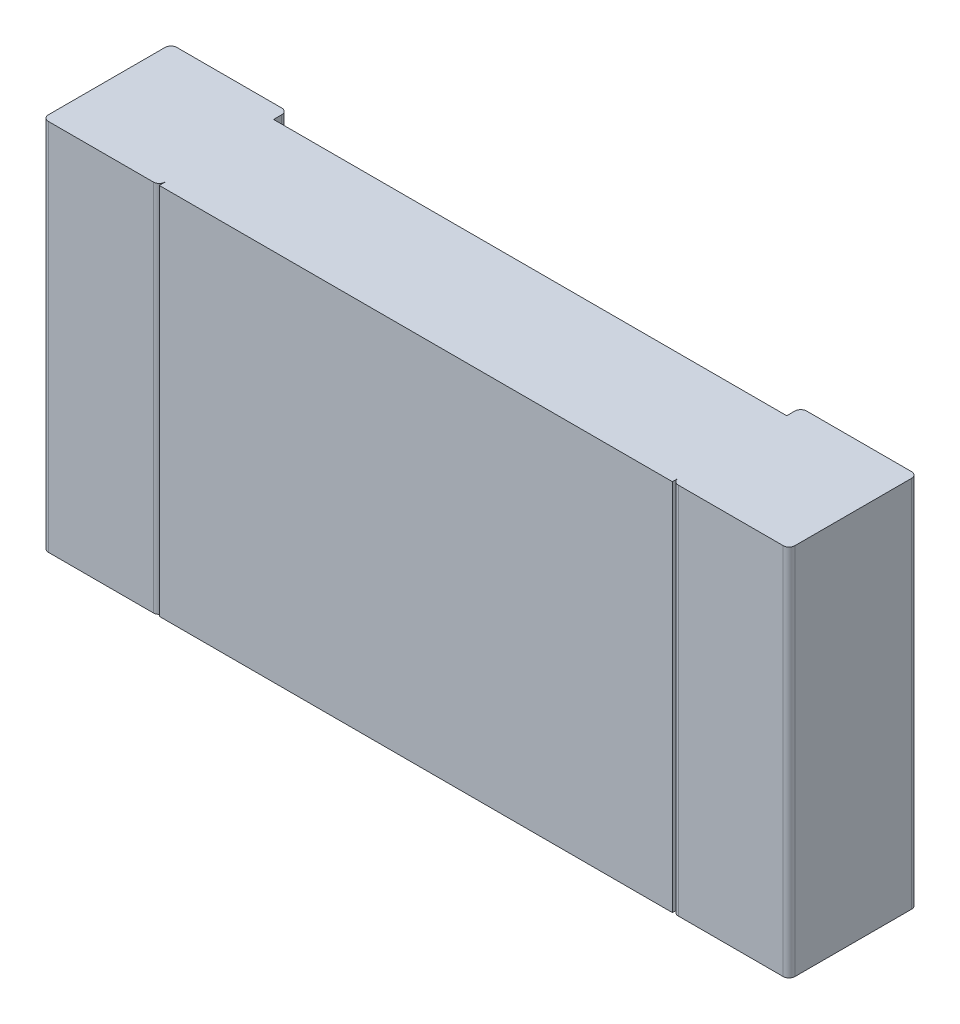
ISO-10303-21;
HEADER;
FILE_DESCRIPTION(('STEP AP214'),'2;1');
FILE_NAME('part.step','',(''),(''),'','','');
FILE_SCHEMA(('AUTOMOTIVE_DESIGN { 1 0 10303 214 1 1 1 1 }'));
ENDSEC;
DATA;
#1=APPLICATION_CONTEXT('core data for automotive mechanical design processes');
#2=APPLICATION_PROTOCOL_DEFINITION('international standard','automotive_design',2000,#1);
#3=PRODUCT_CONTEXT('',#1,'mechanical');
#4=PRODUCT('Part','Part','',(#3));
#5=PRODUCT_RELATED_PRODUCT_CATEGORY('part','',(#4));
#6=PRODUCT_DEFINITION_FORMATION('','',#4);
#7=PRODUCT_DEFINITION_CONTEXT('part definition',#1,'design');
#8=PRODUCT_DEFINITION('design','',#6,#7);
#9=PRODUCT_DEFINITION_SHAPE('','',#8);
#10=(LENGTH_UNIT() NAMED_UNIT(*) SI_UNIT(.MILLI.,.METRE.));
#11=(NAMED_UNIT(*) PLANE_ANGLE_UNIT() SI_UNIT($,.RADIAN.));
#12=(NAMED_UNIT(*) SI_UNIT($,.STERADIAN.) SOLID_ANGLE_UNIT());
#13=UNCERTAINTY_MEASURE_WITH_UNIT(LENGTH_MEASURE(1.E-05),#10,'distance_accuracy_value','');
#14=(GEOMETRIC_REPRESENTATION_CONTEXT(3) GLOBAL_UNCERTAINTY_ASSIGNED_CONTEXT((#13)) GLOBAL_UNIT_ASSIGNED_CONTEXT((#10,
#11,#12)) REPRESENTATION_CONTEXT('',''));
#15=CARTESIAN_POINT('',(0.,0.,0.));
#16=DIRECTION('',(0.,0.,1.));
#17=DIRECTION('',(1.,0.,0.));
#18=AXIS2_PLACEMENT_3D('',#15,#16,#17);
#19=CARTESIAN_POINT('',(-1.575,-0.8,0.025));
#20=DIRECTION('',(0.,1.,0.));
#21=DIRECTION('',(0.,0.,1.));
#22=AXIS2_PLACEMENT_3D('',#19,#20,#21);
#23=CYLINDRICAL_SURFACE('',#22,0.025);
#24=DIRECTION('',(0.,1.,0.));
#25=VECTOR('',#24,1.);
#26=CARTESIAN_POINT('',(-1.575,-0.8,0.));
#27=LINE('',#26,#25);
#28=CARTESIAN_POINT('',(-1.575,0.8,0.));
#29=VERTEX_POINT('',#28);
#30=CARTESIAN_POINT('',(-1.575,-0.8,0.));
#31=VERTEX_POINT('',#30);
#32=EDGE_CURVE('E198',#29,#31,#27,.F.);
#33=ORIENTED_EDGE('',*,*,#32,.T.);
#34=CARTESIAN_POINT('',(-1.575,-0.8,0.025));
#35=DIRECTION('',(0.,1.,0.));
#36=DIRECTION('',(0.,0.,1.));
#37=AXIS2_PLACEMENT_3D('',#34,#35,#36);
#38=CIRCLE('',#37,0.025);
#39=CARTESIAN_POINT('',(-1.6,-0.8,0.025));
#40=VERTEX_POINT('',#39);
#41=EDGE_CURVE('E160',#31,#40,#38,.T.);
#42=ORIENTED_EDGE('',*,*,#41,.T.);
#43=DIRECTION('',(0.,1.,0.));
#44=VECTOR('',#43,1.);
#45=CARTESIAN_POINT('',(-1.6,-0.8,0.025));
#46=LINE('',#45,#44);
#47=CARTESIAN_POINT('',(-1.6,0.8,0.025));
#48=VERTEX_POINT('',#47);
#49=EDGE_CURVE('E163',#40,#48,#46,.T.);
#50=ORIENTED_EDGE('',*,*,#49,.T.);
#51=CARTESIAN_POINT('',(-1.575,0.8,0.025));
#52=DIRECTION('',(0.,1.,0.));
#53=DIRECTION('',(0.,0.,1.));
#54=AXIS2_PLACEMENT_3D('',#51,#52,#53);
#55=CIRCLE('',#54,0.025);
#56=EDGE_CURVE('E19',#48,#29,#55,.F.);
#57=ORIENTED_EDGE('',*,*,#56,.T.);
#58=EDGE_LOOP('',(#33,#42,#50,#57));
#59=FACE_BOUND('',#58,.T.);
#60=ADVANCED_FACE('F16',(#59),#23,.T.);
#61=CARTESIAN_POINT('',(1.575,-0.8,0.025));
#62=DIRECTION('',(0.,1.,0.));
#63=DIRECTION('',(0.,0.,1.));
#64=AXIS2_PLACEMENT_3D('',#61,#62,#63);
#65=CYLINDRICAL_SURFACE('',#64,0.025);
#66=CARTESIAN_POINT('',(1.575,0.8,0.025));
#67=DIRECTION('',(0.,1.,0.));
#68=DIRECTION('',(0.,0.,1.));
#69=AXIS2_PLACEMENT_3D('',#66,#67,#68);
#70=CIRCLE('',#69,0.025);
#71=CARTESIAN_POINT('',(1.575,0.8,0.));
#72=VERTEX_POINT('',#71);
#73=CARTESIAN_POINT('',(1.6,0.8,0.025));
#74=VERTEX_POINT('',#73);
#75=EDGE_CURVE('E199',#72,#74,#70,.F.);
#76=ORIENTED_EDGE('',*,*,#75,.T.);
#77=DIRECTION('',(0.,1.,0.));
#78=VECTOR('',#77,1.);
#79=CARTESIAN_POINT('',(1.6,-0.8,0.025));
#80=LINE('',#79,#78);
#81=CARTESIAN_POINT('',(1.6,-0.8,0.025));
#82=VERTEX_POINT('',#81);
#83=EDGE_CURVE('E175',#82,#74,#80,.T.);
#84=ORIENTED_EDGE('',*,*,#83,.F.);
#85=CARTESIAN_POINT('',(1.575,-0.8,0.025));
#86=DIRECTION('',(0.,1.,0.));
#87=DIRECTION('',(0.,0.,1.));
#88=AXIS2_PLACEMENT_3D('',#85,#86,#87);
#89=CIRCLE('',#88,0.025);
#90=CARTESIAN_POINT('',(1.575,-0.8,0.));
#91=VERTEX_POINT('',#90);
#92=EDGE_CURVE('E243',#82,#91,#89,.T.);
#93=ORIENTED_EDGE('',*,*,#92,.T.);
#94=DIRECTION('',(0.,1.,0.));
#95=VECTOR('',#94,1.);
#96=CARTESIAN_POINT('',(1.575,-0.8,0.));
#97=LINE('',#96,#95);
#98=EDGE_CURVE('E181',#91,#72,#97,.T.);
#99=ORIENTED_EDGE('',*,*,#98,.T.);
#100=EDGE_LOOP('',(#76,#84,#93,#99));
#101=FACE_BOUND('',#100,.T.);
#102=ADVANCED_FACE('F248',(#101),#65,.T.);
#103=CARTESIAN_POINT('',(-1.6,-0.8,0.));
#104=DIRECTION('',(0.,0.,1.));
#105=DIRECTION('',(1.,0.,0.));
#106=AXIS2_PLACEMENT_3D('',#103,#104,#105);
#107=PLANE('',#106);
#108=DIRECTION('',(1.,0.,0.));
#109=VECTOR('',#108,1.);
#110=CARTESIAN_POINT('',(-1.6,-0.8,0.));
#111=LINE('',#110,#109);
#112=CARTESIAN_POINT('',(-1.125,-0.8,0.));
#113=VERTEX_POINT('',#112);
#114=EDGE_CURVE('E191',#31,#113,#111,.T.);
#115=ORIENTED_EDGE('',*,*,#114,.F.);
#116=ORIENTED_EDGE('',*,*,#32,.F.);
#117=DIRECTION('',(1.,0.,0.));
#118=VECTOR('',#117,1.);
#119=CARTESIAN_POINT('',(-1.6,0.8,0.));
#120=LINE('',#119,#118);
#121=CARTESIAN_POINT('',(-1.125,0.8,0.));
#122=VERTEX_POINT('',#121);
#123=EDGE_CURVE('E156',#122,#29,#120,.F.);
#124=ORIENTED_EDGE('',*,*,#123,.F.);
#125=DIRECTION('',(0.,1.,0.));
#126=VECTOR('',#125,1.);
#127=CARTESIAN_POINT('',(-1.125,-0.8,0.));
#128=LINE('',#127,#126);
#129=EDGE_CURVE('E192',#113,#122,#128,.T.);
#130=ORIENTED_EDGE('',*,*,#129,.F.);
#131=EDGE_LOOP('',(#115,#116,#124,#130));
#132=FACE_BOUND('',#131,.T.);
#133=ADVANCED_FACE('F544',(#132),#107,.F.);
#134=CARTESIAN_POINT('',(1.1,-0.8,0.));
#135=DIRECTION('',(0.,0.,1.));
#136=DIRECTION('',(1.,0.,0.));
#137=AXIS2_PLACEMENT_3D('',#134,#135,#136);
#138=PLANE('',#137);
#139=DIRECTION('',(1.,0.,0.));
#140=VECTOR('',#139,1.);
#141=CARTESIAN_POINT('',(1.1,-0.8,0.));
#142=LINE('',#141,#140);
#143=CARTESIAN_POINT('',(1.125,-0.8,0.));
#144=VERTEX_POINT('',#143);
#145=EDGE_CURVE('E187',#144,#91,#142,.T.);
#146=ORIENTED_EDGE('',*,*,#145,.F.);
#147=DIRECTION('',(0.,1.,0.));
#148=VECTOR('',#147,1.);
#149=CARTESIAN_POINT('',(1.125,-0.8,0.));
#150=LINE('',#149,#148);
#151=CARTESIAN_POINT('',(1.125,0.8,0.));
#152=VERTEX_POINT('',#151);
#153=EDGE_CURVE('E182',#152,#144,#150,.F.);
#154=ORIENTED_EDGE('',*,*,#153,.F.);
#155=DIRECTION('',(1.,0.,0.));
#156=VECTOR('',#155,1.);
#157=CARTESIAN_POINT('',(1.1,0.8,0.));
#158=LINE('',#157,#156);
#159=EDGE_CURVE('E189',#72,#152,#158,.F.);
#160=ORIENTED_EDGE('',*,*,#159,.F.);
#161=ORIENTED_EDGE('',*,*,#98,.F.);
#162=EDGE_LOOP('',(#146,#154,#160,#161));
#163=FACE_BOUND('',#162,.T.);
#164=ADVANCED_FACE('F252',(#163),#138,.F.);
#165=CARTESIAN_POINT('',(-1.6,-0.8,0.));
#166=DIRECTION('',(1.,0.,0.));
#167=DIRECTION('',(0.,0.,-1.));
#168=AXIS2_PLACEMENT_3D('',#165,#166,#167);
#169=PLANE('',#168);
#170=DIRECTION('',(0.,0.,-1.));
#171=VECTOR('',#170,1.);
#172=CARTESIAN_POINT('',(-1.6,0.8,0.));
#173=LINE('',#172,#171);
#174=CARTESIAN_POINT('',(-1.6,0.8,0.525));
#175=VERTEX_POINT('',#174);
#176=EDGE_CURVE('E153',#48,#175,#173,.F.);
#177=ORIENTED_EDGE('',*,*,#176,.F.);
#178=ORIENTED_EDGE('',*,*,#49,.F.);
#179=DIRECTION('',(0.,0.,-1.));
#180=VECTOR('',#179,1.);
#181=CARTESIAN_POINT('',(-1.6,-0.8,0.));
#182=LINE('',#181,#180);
#183=CARTESIAN_POINT('',(-1.6,-0.8,0.525));
#184=VERTEX_POINT('',#183);
#185=EDGE_CURVE('E166',#184,#40,#182,.T.);
#186=ORIENTED_EDGE('',*,*,#185,.F.);
#187=DIRECTION('',(0.,1.,0.));
#188=VECTOR('',#187,1.);
#189=CARTESIAN_POINT('',(-1.6,-0.8,0.525));
#190=LINE('',#189,#188);
#191=EDGE_CURVE('E170',#175,#184,#190,.F.);
#192=ORIENTED_EDGE('',*,*,#191,.F.);
#193=EDGE_LOOP('',(#177,#178,#186,#192));
#194=FACE_BOUND('',#193,.T.);
#195=ADVANCED_FACE('F168',(#194),#169,.F.);
#196=CARTESIAN_POINT('',(1.6,-0.8,0.));
#197=DIRECTION('',(1.,0.,0.));
#198=DIRECTION('',(0.,0.,-1.));
#199=AXIS2_PLACEMENT_3D('',#196,#197,#198);
#200=PLANE('',#199);
#201=DIRECTION('',(0.,0.,-1.));
#202=VECTOR('',#201,1.);
#203=CARTESIAN_POINT('',(1.6,0.8,0.));
#204=LINE('',#203,#202);
#205=CARTESIAN_POINT('',(1.6,0.8,0.525));
#206=VERTEX_POINT('',#205);
#207=EDGE_CURVE('E202',#74,#206,#204,.F.);
#208=ORIENTED_EDGE('',*,*,#207,.T.);
#209=DIRECTION('',(0.,1.,0.));
#210=VECTOR('',#209,1.);
#211=CARTESIAN_POINT('',(1.6,-0.8,0.525));
#212=LINE('',#211,#210);
#213=CARTESIAN_POINT('',(1.6,-0.8,0.525));
#214=VERTEX_POINT('',#213);
#215=EDGE_CURVE('E230',#214,#206,#212,.T.);
#216=ORIENTED_EDGE('',*,*,#215,.F.);
#217=DIRECTION('',(0.,0.,-1.));
#218=VECTOR('',#217,1.);
#219=CARTESIAN_POINT('',(1.6,-0.8,0.));
#220=LINE('',#219,#218);
#221=EDGE_CURVE('E172',#214,#82,#220,.T.);
#222=ORIENTED_EDGE('',*,*,#221,.T.);
#223=ORIENTED_EDGE('',*,*,#83,.T.);
#224=EDGE_LOOP('',(#208,#216,#222,#223));
#225=FACE_BOUND('',#224,.T.);
#226=ADVANCED_FACE('F261',(#225),#200,.T.);
#227=CARTESIAN_POINT('',(-1.125,-0.8,0.025));
#228=DIRECTION('',(0.,1.,0.));
#229=DIRECTION('',(0.,0.,1.));
#230=AXIS2_PLACEMENT_3D('',#227,#228,#229);
#231=CYLINDRICAL_SURFACE('',#230,0.025);
#232=CARTESIAN_POINT('',(-1.125,0.8,0.025));
#233=DIRECTION('',(0.,1.,0.));
#234=DIRECTION('',(0.,0.,1.));
#235=AXIS2_PLACEMENT_3D('',#232,#233,#234);
#236=CIRCLE('',#235,0.025);
#237=CARTESIAN_POINT('',(-1.1,0.8,0.025));
#238=VERTEX_POINT('',#237);
#239=EDGE_CURVE('E195',#122,#238,#236,.F.);
#240=ORIENTED_EDGE('',*,*,#239,.T.);
#241=DIRECTION('',(0.,1.,0.));
#242=VECTOR('',#241,1.);
#243=CARTESIAN_POINT('',(-1.1,-0.8,0.025));
#244=LINE('',#243,#242);
#245=CARTESIAN_POINT('',(-1.1,-0.8,0.025));
#246=VERTEX_POINT('',#245);
#247=EDGE_CURVE('E323',#246,#238,#244,.T.);
#248=ORIENTED_EDGE('',*,*,#247,.F.);
#249=CARTESIAN_POINT('',(-1.125,-0.8,0.025));
#250=DIRECTION('',(0.,1.,0.));
#251=DIRECTION('',(0.,0.,1.));
#252=AXIS2_PLACEMENT_3D('',#249,#250,#251);
#253=CIRCLE('',#252,0.025);
#254=EDGE_CURVE('E196',#246,#113,#253,.T.);
#255=ORIENTED_EDGE('',*,*,#254,.T.);
#256=ORIENTED_EDGE('',*,*,#129,.T.);
#257=EDGE_LOOP('',(#240,#248,#255,#256));
#258=FACE_BOUND('',#257,.T.);
#259=ADVANCED_FACE('F517',(#258),#231,.T.);
#260=CARTESIAN_POINT('',(1.125,-0.8,0.025));
#261=DIRECTION('',(0.,1.,0.));
#262=DIRECTION('',(0.,0.,1.));
#263=AXIS2_PLACEMENT_3D('',#260,#261,#262);
#264=CYLINDRICAL_SURFACE('',#263,0.025);
#265=ORIENTED_EDGE('',*,*,#153,.T.);
#266=CARTESIAN_POINT('',(1.125,-0.8,0.025));
#267=DIRECTION('',(0.,1.,0.));
#268=DIRECTION('',(0.,0.,1.));
#269=AXIS2_PLACEMENT_3D('',#266,#267,#268);
#270=CIRCLE('',#269,0.025);
#271=CARTESIAN_POINT('',(1.1,-0.8,0.025));
#272=VERTEX_POINT('',#271);
#273=EDGE_CURVE('E185',#144,#272,#270,.T.);
#274=ORIENTED_EDGE('',*,*,#273,.T.);
#275=DIRECTION('',(0.,1.,0.));
#276=VECTOR('',#275,1.);
#277=CARTESIAN_POINT('',(1.1,-0.8,0.025));
#278=LINE('',#277,#276);
#279=CARTESIAN_POINT('',(1.1,0.8,0.025));
#280=VERTEX_POINT('',#279);
#281=EDGE_CURVE('E315',#272,#280,#278,.T.);
#282=ORIENTED_EDGE('',*,*,#281,.T.);
#283=CARTESIAN_POINT('',(1.125,0.8,0.025));
#284=DIRECTION('',(0.,1.,0.));
#285=DIRECTION('',(0.,0.,1.));
#286=AXIS2_PLACEMENT_3D('',#283,#284,#285);
#287=CIRCLE('',#286,0.025);
#288=EDGE_CURVE('E186',#280,#152,#287,.F.);
#289=ORIENTED_EDGE('',*,*,#288,.T.);
#290=EDGE_LOOP('',(#265,#274,#282,#289));
#291=FACE_BOUND('',#290,.T.);
#292=ADVANCED_FACE('F510',(#291),#264,.T.);
#293=CARTESIAN_POINT('',(-1.575,-0.8,0.525));
#294=DIRECTION('',(0.,1.,0.));
#295=DIRECTION('',(0.,0.,1.));
#296=AXIS2_PLACEMENT_3D('',#293,#294,#295);
#297=CYLINDRICAL_SURFACE('',#296,0.025);
#298=CARTESIAN_POINT('',(-1.575,0.8,0.525));
#299=DIRECTION('',(0.,1.,0.));
#300=DIRECTION('',(0.,0.,1.));
#301=AXIS2_PLACEMENT_3D('',#298,#299,#300);
#302=CIRCLE('',#301,0.025);
#303=CARTESIAN_POINT('',(-1.575,0.8,0.55));
#304=VERTEX_POINT('',#303);
#305=EDGE_CURVE('E231',#304,#175,#302,.F.);
#306=ORIENTED_EDGE('',*,*,#305,.T.);
#307=ORIENTED_EDGE('',*,*,#191,.T.);
#308=CARTESIAN_POINT('',(-1.575,-0.8,0.525));
#309=DIRECTION('',(0.,1.,0.));
#310=DIRECTION('',(0.,0.,1.));
#311=AXIS2_PLACEMENT_3D('',#308,#309,#310);
#312=CIRCLE('',#311,0.025);
#313=CARTESIAN_POINT('',(-1.575,-0.8,0.55));
#314=VERTEX_POINT('',#313);
#315=EDGE_CURVE('E233',#184,#314,#312,.T.);
#316=ORIENTED_EDGE('',*,*,#315,.T.);
#317=DIRECTION('',(0.,1.,0.));
#318=VECTOR('',#317,1.);
#319=CARTESIAN_POINT('',(-1.575,-0.8,0.55));
#320=LINE('',#319,#318);
#321=EDGE_CURVE('E310',#304,#314,#320,.F.);
#322=ORIENTED_EDGE('',*,*,#321,.F.);
#323=EDGE_LOOP('',(#306,#307,#316,#322));
#324=FACE_BOUND('',#323,.T.);
#325=ADVANCED_FACE('F336',(#324),#297,.T.);
#326=CARTESIAN_POINT('',(1.575,-0.8,0.525));
#327=DIRECTION('',(0.,1.,0.));
#328=DIRECTION('',(0.,0.,1.));
#329=AXIS2_PLACEMENT_3D('',#326,#327,#328);
#330=CYLINDRICAL_SURFACE('',#329,0.025);
#331=DIRECTION('',(0.,1.,0.));
#332=VECTOR('',#331,1.);
#333=CARTESIAN_POINT('',(1.575,-0.8,0.55));
#334=LINE('',#333,#332);
#335=CARTESIAN_POINT('',(1.575,-0.8,0.55));
#336=VERTEX_POINT('',#335);
#337=CARTESIAN_POINT('',(1.575,0.8,0.55));
#338=VERTEX_POINT('',#337);
#339=EDGE_CURVE('E268',#336,#338,#334,.T.);
#340=ORIENTED_EDGE('',*,*,#339,.F.);
#341=CARTESIAN_POINT('',(1.575,-0.8,0.525));
#342=DIRECTION('',(0.,1.,0.));
#343=DIRECTION('',(0.,0.,1.));
#344=AXIS2_PLACEMENT_3D('',#341,#342,#343);
#345=CIRCLE('',#344,0.025);
#346=EDGE_CURVE('E223',#336,#214,#345,.T.);
#347=ORIENTED_EDGE('',*,*,#346,.T.);
#348=ORIENTED_EDGE('',*,*,#215,.T.);
#349=CARTESIAN_POINT('',(1.575,0.8,0.525));
#350=DIRECTION('',(0.,1.,0.));
#351=DIRECTION('',(0.,0.,1.));
#352=AXIS2_PLACEMENT_3D('',#349,#350,#351);
#353=CIRCLE('',#352,0.025);
#354=EDGE_CURVE('E227',#206,#338,#353,.F.);
#355=ORIENTED_EDGE('',*,*,#354,.T.);
#356=EDGE_LOOP('',(#340,#347,#348,#355));
#357=FACE_BOUND('',#356,.T.);
#358=ADVANCED_FACE('F269',(#357),#330,.T.);
#359=CARTESIAN_POINT('',(-1.1,-0.8,0.));
#360=DIRECTION('',(1.,0.,0.));
#361=DIRECTION('',(0.,0.,-1.));
#362=AXIS2_PLACEMENT_3D('',#359,#360,#361);
#363=PLANE('',#362);
#364=DIRECTION('',(0.,0.,-1.));
#365=VECTOR('',#364,1.);
#366=CARTESIAN_POINT('',(-1.1,0.8,0.));
#367=LINE('',#366,#365);
#368=CARTESIAN_POINT('',(-1.1,0.8,0.06));
#369=VERTEX_POINT('',#368);
#370=EDGE_CURVE('E316',#238,#369,#367,.F.);
#371=ORIENTED_EDGE('',*,*,#370,.T.);
#372=DIRECTION('',(0.,1.,0.));
#373=VECTOR('',#372,1.);
#374=CARTESIAN_POINT('',(-1.1,-0.8,0.06));
#375=LINE('',#374,#373);
#376=CARTESIAN_POINT('',(-1.1,-0.8,0.06));
#377=VERTEX_POINT('',#376);
#378=EDGE_CURVE('E271',#369,#377,#375,.F.);
#379=ORIENTED_EDGE('',*,*,#378,.T.);
#380=DIRECTION('',(0.,0.,-1.));
#381=VECTOR('',#380,1.);
#382=CARTESIAN_POINT('',(-1.1,-0.8,0.));
#383=LINE('',#382,#381);
#384=EDGE_CURVE('E226',#377,#246,#383,.T.);
#385=ORIENTED_EDGE('',*,*,#384,.T.);
#386=ORIENTED_EDGE('',*,*,#247,.T.);
#387=EDGE_LOOP('',(#371,#379,#385,#386));
#388=FACE_BOUND('',#387,.T.);
#389=ADVANCED_FACE('F489',(#388),#363,.T.);
#390=CARTESIAN_POINT('',(1.1,-0.8,0.));
#391=DIRECTION('',(1.,0.,0.));
#392=DIRECTION('',(0.,0.,-1.));
#393=AXIS2_PLACEMENT_3D('',#390,#391,#392);
#394=PLANE('',#393);
#395=DIRECTION('',(0.,0.,-1.));
#396=VECTOR('',#395,1.);
#397=CARTESIAN_POINT('',(1.1,0.8,0.));
#398=LINE('',#397,#396);
#399=CARTESIAN_POINT('',(1.1,0.8,0.06));
#400=VERTEX_POINT('',#399);
#401=EDGE_CURVE('E311',#280,#400,#398,.F.);
#402=ORIENTED_EDGE('',*,*,#401,.F.);
#403=ORIENTED_EDGE('',*,*,#281,.F.);
#404=DIRECTION('',(0.,0.,-1.));
#405=VECTOR('',#404,1.);
#406=CARTESIAN_POINT('',(1.1,-0.8,0.));
#407=LINE('',#406,#405);
#408=CARTESIAN_POINT('',(1.1,-0.8,0.06));
#409=VERTEX_POINT('',#408);
#410=EDGE_CURVE('E313',#409,#272,#407,.T.);
#411=ORIENTED_EDGE('',*,*,#410,.F.);
#412=DIRECTION('',(0.,1.,0.));
#413=VECTOR('',#412,1.);
#414=CARTESIAN_POINT('',(1.1,-0.8,0.06));
#415=LINE('',#414,#413);
#416=EDGE_CURVE('E292',#409,#400,#415,.T.);
#417=ORIENTED_EDGE('',*,*,#416,.T.);
#418=EDGE_LOOP('',(#402,#403,#411,#417));
#419=FACE_BOUND('',#418,.T.);
#420=ADVANCED_FACE('F482',(#419),#394,.F.);
#421=CARTESIAN_POINT('',(-1.6,-0.8,0.55));
#422=DIRECTION('',(0.,0.,1.));
#423=DIRECTION('',(1.,0.,0.));
#424=AXIS2_PLACEMENT_3D('',#421,#422,#423);
#425=PLANE('',#424);
#426=DIRECTION('',(1.,0.,0.));
#427=VECTOR('',#426,1.);
#428=CARTESIAN_POINT('',(-1.6,-0.8,0.55));
#429=LINE('',#428,#427);
#430=CARTESIAN_POINT('',(-1.125,-0.8,0.55));
#431=VERTEX_POINT('',#430);
#432=EDGE_CURVE('E301',#314,#431,#429,.T.);
#433=ORIENTED_EDGE('',*,*,#432,.T.);
#434=DIRECTION('',(0.,1.,0.));
#435=VECTOR('',#434,1.);
#436=CARTESIAN_POINT('',(-1.125,-0.8,0.55));
#437=LINE('',#436,#435);
#438=CARTESIAN_POINT('',(-1.125,0.8,0.55));
#439=VERTEX_POINT('',#438);
#440=EDGE_CURVE('E289',#439,#431,#437,.F.);
#441=ORIENTED_EDGE('',*,*,#440,.F.);
#442=DIRECTION('',(1.,0.,0.));
#443=VECTOR('',#442,1.);
#444=CARTESIAN_POINT('',(-1.6,0.8,0.55));
#445=LINE('',#444,#443);
#446=EDGE_CURVE('E307',#439,#304,#445,.F.);
#447=ORIENTED_EDGE('',*,*,#446,.T.);
#448=ORIENTED_EDGE('',*,*,#321,.T.);
#449=EDGE_LOOP('',(#433,#441,#447,#448));
#450=FACE_BOUND('',#449,.T.);
#451=ADVANCED_FACE('F344',(#450),#425,.T.);
#452=CARTESIAN_POINT('',(1.1,-0.8,0.55));
#453=DIRECTION('',(0.,0.,1.));
#454=DIRECTION('',(1.,0.,0.));
#455=AXIS2_PLACEMENT_3D('',#452,#453,#454);
#456=PLANE('',#455);
#457=DIRECTION('',(1.,0.,0.));
#458=VECTOR('',#457,1.);
#459=CARTESIAN_POINT('',(1.1,-0.8,0.55));
#460=LINE('',#459,#458);
#461=CARTESIAN_POINT('',(1.125,-0.8,0.55));
#462=VERTEX_POINT('',#461);
#463=EDGE_CURVE('E219',#462,#336,#460,.T.);
#464=ORIENTED_EDGE('',*,*,#463,.T.);
#465=ORIENTED_EDGE('',*,*,#339,.T.);
#466=DIRECTION('',(1.,0.,0.));
#467=VECTOR('',#466,1.);
#468=CARTESIAN_POINT('',(1.1,0.8,0.55));
#469=LINE('',#468,#467);
#470=CARTESIAN_POINT('',(1.125,0.8,0.55));
#471=VERTEX_POINT('',#470);
#472=EDGE_CURVE('E272',#338,#471,#469,.F.);
#473=ORIENTED_EDGE('',*,*,#472,.T.);
#474=DIRECTION('',(0.,1.,0.));
#475=VECTOR('',#474,1.);
#476=CARTESIAN_POINT('',(1.125,-0.8,0.55));
#477=LINE('',#476,#475);
#478=EDGE_CURVE('E218',#462,#471,#477,.T.);
#479=ORIENTED_EDGE('',*,*,#478,.F.);
#480=EDGE_LOOP('',(#464,#465,#473,#479));
#481=FACE_BOUND('',#480,.T.);
#482=ADVANCED_FACE('F274',(#481),#456,.T.);
#483=CARTESIAN_POINT('',(-1.54,-0.8,0.06));
#484=DIRECTION('',(0.,0.,1.));
#485=DIRECTION('',(1.,0.,0.));
#486=AXIS2_PLACEMENT_3D('',#483,#484,#485);
#487=PLANE('',#486);
#488=ORIENTED_EDGE('',*,*,#416,.F.);
#489=DIRECTION('',(1.,0.,0.));
#490=VECTOR('',#489,1.);
#491=CARTESIAN_POINT('',(-1.54,-0.8,0.06));
#492=LINE('',#491,#490);
#493=EDGE_CURVE('E222',#409,#377,#492,.F.);
#494=ORIENTED_EDGE('',*,*,#493,.T.);
#495=ORIENTED_EDGE('',*,*,#378,.F.);
#496=DIRECTION('',(1.,0.,0.));
#497=VECTOR('',#496,1.);
#498=CARTESIAN_POINT('',(-1.54,0.8,0.06));
#499=LINE('',#498,#497);
#500=EDGE_CURVE('E214',#400,#369,#499,.F.);
#501=ORIENTED_EDGE('',*,*,#500,.F.);
#502=EDGE_LOOP('',(#488,#494,#495,#501));
#503=FACE_BOUND('',#502,.T.);
#504=ADVANCED_FACE('F391',(#503),#487,.F.);
#505=CARTESIAN_POINT('',(-1.125,-0.8,0.525));
#506=DIRECTION('',(0.,1.,0.));
#507=DIRECTION('',(0.,0.,1.));
#508=AXIS2_PLACEMENT_3D('',#505,#506,#507);
#509=CYLINDRICAL_SURFACE('',#508,0.025);
#510=ORIENTED_EDGE('',*,*,#440,.T.);
#511=CARTESIAN_POINT('',(-1.125,-0.8,0.525));
#512=DIRECTION('',(0.,1.,0.));
#513=DIRECTION('',(0.,0.,1.));
#514=AXIS2_PLACEMENT_3D('',#511,#512,#513);
#515=CIRCLE('',#514,0.025);
#516=CARTESIAN_POINT('',(-1.1,-0.8,0.525));
#517=VERTEX_POINT('',#516);
#518=EDGE_CURVE('E220',#431,#517,#515,.T.);
#519=ORIENTED_EDGE('',*,*,#518,.T.);
#520=DIRECTION('',(0.,1.,0.));
#521=VECTOR('',#520,1.);
#522=CARTESIAN_POINT('',(-1.1,-0.8,0.525));
#523=LINE('',#522,#521);
#524=CARTESIAN_POINT('',(-1.1,0.8,0.525));
#525=VERTEX_POINT('',#524);
#526=EDGE_CURVE('E210',#517,#525,#523,.T.);
#527=ORIENTED_EDGE('',*,*,#526,.T.);
#528=CARTESIAN_POINT('',(-1.125,0.8,0.525));
#529=DIRECTION('',(0.,1.,0.));
#530=DIRECTION('',(0.,0.,1.));
#531=AXIS2_PLACEMENT_3D('',#528,#529,#530);
#532=CIRCLE('',#531,0.025);
#533=EDGE_CURVE('E211',#439,#525,#532,.T.);
#534=ORIENTED_EDGE('',*,*,#533,.F.);
#535=EDGE_LOOP('',(#510,#519,#527,#534));
#536=FACE_BOUND('',#535,.T.);
#537=ADVANCED_FACE('F347',(#536),#509,.T.);
#538=CARTESIAN_POINT('',(1.125,-0.8,0.525));
#539=DIRECTION('',(0.,1.,0.));
#540=DIRECTION('',(0.,0.,1.));
#541=AXIS2_PLACEMENT_3D('',#538,#539,#540);
#542=CYLINDRICAL_SURFACE('',#541,0.025);
#543=CARTESIAN_POINT('',(1.125,0.8,0.525));
#544=DIRECTION('',(0.,1.,0.));
#545=DIRECTION('',(0.,0.,1.));
#546=AXIS2_PLACEMENT_3D('',#543,#544,#545);
#547=CIRCLE('',#546,0.025);
#548=CARTESIAN_POINT('',(1.1,0.8,0.525));
#549=VERTEX_POINT('',#548);
#550=EDGE_CURVE('E207',#549,#471,#547,.T.);
#551=ORIENTED_EDGE('',*,*,#550,.F.);
#552=DIRECTION('',(0.,1.,0.));
#553=VECTOR('',#552,1.);
#554=CARTESIAN_POINT('',(1.1,-0.8,0.525));
#555=LINE('',#554,#553);
#556=CARTESIAN_POINT('',(1.1,-0.8,0.525));
#557=VERTEX_POINT('',#556);
#558=EDGE_CURVE('E358',#557,#549,#555,.T.);
#559=ORIENTED_EDGE('',*,*,#558,.F.);
#560=CARTESIAN_POINT('',(1.125,-0.8,0.525));
#561=DIRECTION('',(0.,1.,0.));
#562=DIRECTION('',(0.,0.,1.));
#563=AXIS2_PLACEMENT_3D('',#560,#561,#562);
#564=CIRCLE('',#563,0.025);
#565=EDGE_CURVE('E215',#557,#462,#564,.T.);
#566=ORIENTED_EDGE('',*,*,#565,.T.);
#567=ORIENTED_EDGE('',*,*,#478,.T.);
#568=EDGE_LOOP('',(#551,#559,#566,#567));
#569=FACE_BOUND('',#568,.T.);
#570=ADVANCED_FACE('F381',(#569),#542,.T.);
#571=CARTESIAN_POINT('',(-1.1,-0.8,0.49));
#572=DIRECTION('',(1.,0.,0.));
#573=DIRECTION('',(0.,0.,-1.));
#574=AXIS2_PLACEMENT_3D('',#571,#572,#573);
#575=PLANE('',#574);
#576=DIRECTION('',(0.,0.,1.));
#577=VECTOR('',#576,1.);
#578=CARTESIAN_POINT('',(-1.1,0.8,0.49));
#579=LINE('',#578,#577);
#580=CARTESIAN_POINT('',(-1.1,0.8,0.55));
#581=VERTEX_POINT('',#580);
#582=EDGE_CURVE('E354',#525,#581,#579,.T.);
#583=ORIENTED_EDGE('',*,*,#582,.F.);
#584=ORIENTED_EDGE('',*,*,#526,.F.);
#585=DIRECTION('',(0.,0.,1.));
#586=VECTOR('',#585,1.);
#587=CARTESIAN_POINT('',(-1.1,-0.8,0.49));
#588=LINE('',#587,#586);
#589=CARTESIAN_POINT('',(-1.1,-0.8,0.55));
#590=VERTEX_POINT('',#589);
#591=EDGE_CURVE('E281',#517,#590,#588,.T.);
#592=ORIENTED_EDGE('',*,*,#591,.T.);
#593=DIRECTION('',(0.,1.,0.));
#594=VECTOR('',#593,1.);
#595=CARTESIAN_POINT('',(-1.1,-0.8,0.55));
#596=LINE('',#595,#594);
#597=EDGE_CURVE('E362',#581,#590,#596,.F.);
#598=ORIENTED_EDGE('',*,*,#597,.F.);
#599=EDGE_LOOP('',(#583,#584,#592,#598));
#600=FACE_BOUND('',#599,.T.);
#601=ADVANCED_FACE('F383',(#600),#575,.F.);
#602=CARTESIAN_POINT('',(-1.1,-0.8,0.49));
#603=DIRECTION('',(0.,1.,0.));
#604=DIRECTION('',(0.,0.,1.));
#605=AXIS2_PLACEMENT_3D('',#602,#603,#604);
#606=PLANE('',#605);
#607=ORIENTED_EDGE('',*,*,#384,.F.);
#608=ORIENTED_EDGE('',*,*,#493,.F.);
#609=ORIENTED_EDGE('',*,*,#410,.T.);
#610=ORIENTED_EDGE('',*,*,#273,.F.);
#611=ORIENTED_EDGE('',*,*,#145,.T.);
#612=ORIENTED_EDGE('',*,*,#92,.F.);
#613=ORIENTED_EDGE('',*,*,#221,.F.);
#614=ORIENTED_EDGE('',*,*,#346,.F.);
#615=ORIENTED_EDGE('',*,*,#463,.F.);
#616=ORIENTED_EDGE('',*,*,#565,.F.);
#617=DIRECTION('',(0.,0.,-1.));
#618=VECTOR('',#617,1.);
#619=CARTESIAN_POINT('',(1.1,-0.8,0.49));
#620=LINE('',#619,#618);
#621=CARTESIAN_POINT('',(1.1,-0.8,0.55));
#622=VERTEX_POINT('',#621);
#623=EDGE_CURVE('E284',#622,#557,#620,.T.);
#624=ORIENTED_EDGE('',*,*,#623,.F.);
#625=DIRECTION('',(1.,0.,0.));
#626=VECTOR('',#625,1.);
#627=CARTESIAN_POINT('',(-1.1,-0.8,0.55));
#628=LINE('',#627,#626);
#629=EDGE_CURVE('E360',#590,#622,#628,.T.);
#630=ORIENTED_EDGE('',*,*,#629,.F.);
#631=ORIENTED_EDGE('',*,*,#591,.F.);
#632=ORIENTED_EDGE('',*,*,#518,.F.);
#633=ORIENTED_EDGE('',*,*,#432,.F.);
#634=ORIENTED_EDGE('',*,*,#315,.F.);
#635=ORIENTED_EDGE('',*,*,#185,.T.);
#636=ORIENTED_EDGE('',*,*,#41,.F.);
#637=ORIENTED_EDGE('',*,*,#114,.T.);
#638=ORIENTED_EDGE('',*,*,#254,.F.);
#639=EDGE_LOOP('',(#607,#608,#609,#610,#611,#612,#613,#614,#615,#616,#624,#630,#631,#632,#633,
#634,#635,#636,#637,#638));
#640=FACE_BOUND('',#639,.T.);
#641=ADVANCED_FACE('F262',(#640),#606,.F.);
#642=CARTESIAN_POINT('',(1.1,-0.8,0.49));
#643=DIRECTION('',(1.,0.,0.));
#644=DIRECTION('',(0.,0.,-1.));
#645=AXIS2_PLACEMENT_3D('',#642,#643,#644);
#646=PLANE('',#645);
#647=DIRECTION('',(0.,0.,1.));
#648=VECTOR('',#647,1.);
#649=CARTESIAN_POINT('',(1.1,0.8,0.49));
#650=LINE('',#649,#648);
#651=CARTESIAN_POINT('',(1.1,0.8,0.55));
#652=VERTEX_POINT('',#651);
#653=EDGE_CURVE('E34',#652,#549,#650,.F.);
#654=ORIENTED_EDGE('',*,*,#653,.F.);
#655=DIRECTION('',(0.,1.,0.));
#656=VECTOR('',#655,1.);
#657=CARTESIAN_POINT('',(1.1,-0.8,0.55));
#658=LINE('',#657,#656);
#659=EDGE_CURVE('E25',#622,#652,#658,.T.);
#660=ORIENTED_EDGE('',*,*,#659,.F.);
#661=ORIENTED_EDGE('',*,*,#623,.T.);
#662=ORIENTED_EDGE('',*,*,#558,.T.);
#663=EDGE_LOOP('',(#654,#660,#661,#662));
#664=FACE_BOUND('',#663,.T.);
#665=ADVANCED_FACE('F379',(#664),#646,.T.);
#666=CARTESIAN_POINT('',(-1.1,0.8,0.49));
#667=DIRECTION('',(0.,1.,0.));
#668=DIRECTION('',(0.,0.,1.));
#669=AXIS2_PLACEMENT_3D('',#666,#667,#668);
#670=PLANE('',#669);
#671=ORIENTED_EDGE('',*,*,#500,.T.);
#672=ORIENTED_EDGE('',*,*,#370,.F.);
#673=ORIENTED_EDGE('',*,*,#239,.F.);
#674=ORIENTED_EDGE('',*,*,#123,.T.);
#675=ORIENTED_EDGE('',*,*,#56,.F.);
#676=ORIENTED_EDGE('',*,*,#176,.T.);
#677=ORIENTED_EDGE('',*,*,#305,.F.);
#678=ORIENTED_EDGE('',*,*,#446,.F.);
#679=ORIENTED_EDGE('',*,*,#533,.T.);
#680=ORIENTED_EDGE('',*,*,#582,.T.);
#681=DIRECTION('',(1.,0.,0.));
#682=VECTOR('',#681,1.);
#683=CARTESIAN_POINT('',(-1.1,0.8,0.55));
#684=LINE('',#683,#682);
#685=EDGE_CURVE('E11',#652,#581,#684,.F.);
#686=ORIENTED_EDGE('',*,*,#685,.F.);
#687=ORIENTED_EDGE('',*,*,#653,.T.);
#688=ORIENTED_EDGE('',*,*,#550,.T.);
#689=ORIENTED_EDGE('',*,*,#472,.F.);
#690=ORIENTED_EDGE('',*,*,#354,.F.);
#691=ORIENTED_EDGE('',*,*,#207,.F.);
#692=ORIENTED_EDGE('',*,*,#75,.F.);
#693=ORIENTED_EDGE('',*,*,#159,.T.);
#694=ORIENTED_EDGE('',*,*,#288,.F.);
#695=ORIENTED_EDGE('',*,*,#401,.T.);
#696=EDGE_LOOP('',(#671,#672,#673,#674,#675,#676,#677,#678,#679,#680,#686,#687,#688,#689,#690,
#691,#692,#693,#694,#695));
#697=FACE_BOUND('',#696,.T.);
#698=ADVANCED_FACE('F151',(#697),#670,.T.);
#699=CARTESIAN_POINT('',(-1.1,-0.8,0.55));
#700=DIRECTION('',(0.,0.,1.));
#701=DIRECTION('',(1.,0.,0.));
#702=AXIS2_PLACEMENT_3D('',#699,#700,#701);
#703=PLANE('',#702);
#704=ORIENTED_EDGE('',*,*,#659,.T.);
#705=ORIENTED_EDGE('',*,*,#685,.T.);
#706=ORIENTED_EDGE('',*,*,#597,.T.);
#707=ORIENTED_EDGE('',*,*,#629,.T.);
#708=EDGE_LOOP('',(#704,#705,#706,#707));
#709=FACE_BOUND('',#708,.T.);
#710=ADVANCED_FACE('F378',(#709),#703,.T.);
#711=CLOSED_SHELL('',(#60,#102,#133,#164,#195,#226,#259,#292,#325,#358,#389,#420,#451,#482,#504,
#537,#570,#601,#641,#665,#698,#710));
#712=MANIFOLD_SOLID_BREP('B1',#711);
#713=ADVANCED_BREP_SHAPE_REPRESENTATION('',(#18,#712),#14);
#714=SHAPE_DEFINITION_REPRESENTATION(#9,#713);
ENDSEC;
END-ISO-10303-21;
